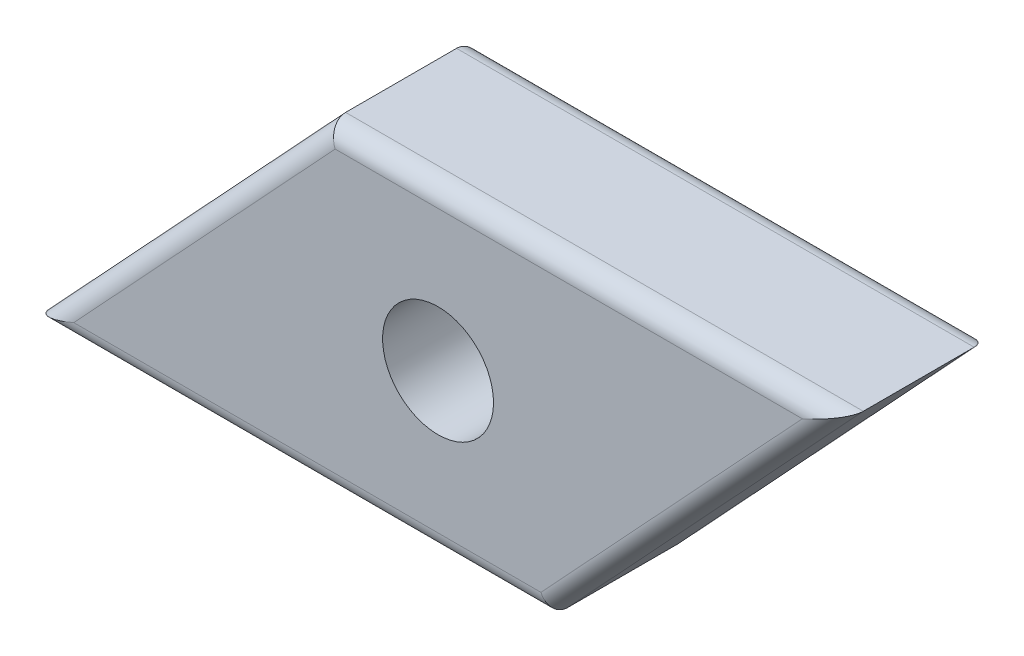
ISO-10303-21;
HEADER;
FILE_DESCRIPTION(('STEP AP214'),'2;1');
FILE_NAME('part.step','',(''),(''),'','','');
FILE_SCHEMA(('AUTOMOTIVE_DESIGN { 1 0 10303 214 1 1 1 1 }'));
ENDSEC;
DATA;
#1=APPLICATION_CONTEXT('core data for automotive mechanical design processes');
#2=APPLICATION_PROTOCOL_DEFINITION('international standard','automotive_design',2000,#1);
#3=PRODUCT_CONTEXT('',#1,'mechanical');
#4=PRODUCT('Part','Part','',(#3));
#5=PRODUCT_RELATED_PRODUCT_CATEGORY('part','',(#4));
#6=PRODUCT_DEFINITION_FORMATION('','',#4);
#7=PRODUCT_DEFINITION_CONTEXT('part definition',#1,'design');
#8=PRODUCT_DEFINITION('design','',#6,#7);
#9=PRODUCT_DEFINITION_SHAPE('','',#8);
#10=(LENGTH_UNIT() NAMED_UNIT(*) SI_UNIT(.MILLI.,.METRE.));
#11=(NAMED_UNIT(*) PLANE_ANGLE_UNIT() SI_UNIT($,.RADIAN.));
#12=(NAMED_UNIT(*) SI_UNIT($,.STERADIAN.) SOLID_ANGLE_UNIT());
#13=UNCERTAINTY_MEASURE_WITH_UNIT(LENGTH_MEASURE(1.E-05),#10,'distance_accuracy_value','');
#14=(GEOMETRIC_REPRESENTATION_CONTEXT(3) GLOBAL_UNCERTAINTY_ASSIGNED_CONTEXT((#13)) GLOBAL_UNIT_ASSIGNED_CONTEXT((#10,
#11,#12)) REPRESENTATION_CONTEXT('',''));
#15=CARTESIAN_POINT('',(0.,0.,0.));
#16=DIRECTION('',(0.,0.,1.));
#17=DIRECTION('',(1.,0.,0.));
#18=AXIS2_PLACEMENT_3D('',#15,#16,#17);
#19=CARTESIAN_POINT('',(0.,0.,4.));
#20=DIRECTION('',(0.,0.,-1.));
#21=DIRECTION('',(-1.,0.,0.));
#22=AXIS2_PLACEMENT_3D('',#19,#20,#21);
#23=PLANE('',#22);
#24=DIRECTION('',(1.,0.,0.));
#25=VECTOR('',#24,1.);
#26=CARTESIAN_POINT('',(0.,-3.8,4.));
#27=LINE('',#26,#25);
#28=CARTESIAN_POINT('',(-9.8519978204639,-3.8,4.));
#29=VERTEX_POINT('',#28);
#30=CARTESIAN_POINT('',(2.78223037860344,-3.8,4.));
#31=VERTEX_POINT('',#30);
#32=EDGE_CURVE('E115',#29,#31,#27,.T.);
#33=ORIENTED_EDGE('',*,*,#32,.T.);
#34=DIRECTION('',(0.681103942477287,0.732186738163084,0.));
#35=VECTOR('',#34,1.);
#36=CARTESIAN_POINT('',(3.38658856771173,-3.15031494670859,4.));
#37=LINE('',#36,#35);
#38=CARTESIAN_POINT('',(9.8519978204639,3.8,4.));
#39=VERTEX_POINT('',#38);
#40=EDGE_CURVE('E9',#31,#39,#37,.T.);
#41=ORIENTED_EDGE('',*,*,#40,.T.);
#42=DIRECTION('',(-1.,0.,0.));
#43=VECTOR('',#42,1.);
#44=CARTESIAN_POINT('',(0.,3.8,4.));
#45=LINE('',#44,#43);
#46=CARTESIAN_POINT('',(-2.78223037860344,3.8,4.));
#47=VERTEX_POINT('',#46);
#48=EDGE_CURVE('E24',#39,#47,#45,.T.);
#49=ORIENTED_EDGE('',*,*,#48,.T.);
#50=DIRECTION('',(-0.681103942477287,-0.732186738163084,0.));
#51=VECTOR('',#50,1.);
#52=CARTESIAN_POINT('',(-3.38658856771173,3.15031494670859,4.));
#53=LINE('',#52,#51);
#54=EDGE_CURVE('E133',#47,#29,#53,.T.);
#55=ORIENTED_EDGE('',*,*,#54,.T.);
#56=EDGE_LOOP('',(#33,#41,#49,#55));
#57=FACE_BOUND('',#56,.T.);
#58=CARTESIAN_POINT('',(0.,0.,4.));
#59=DIRECTION('',(0.,0.,1.));
#60=DIRECTION('',(1.,0.,0.));
#61=AXIS2_PLACEMENT_3D('',#58,#59,#60);
#62=CIRCLE('',#61,1.5);
#63=CARTESIAN_POINT('',(1.5,0.,4.));
#64=VERTEX_POINT('',#63);
#65=EDGE_CURVE('E160',#64,#64,#62,.T.);
#66=ORIENTED_EDGE('',*,*,#65,.F.);
#67=EDGE_LOOP('',(#66));
#68=FACE_BOUND('',#67,.T.);
#69=ADVANCED_FACE('F15',(#57,#68),#23,.F.);
#70=CARTESIAN_POINT('',(0.,0.,0.));
#71=DIRECTION('',(0.,0.,-1.));
#72=DIRECTION('',(-1.,0.,0.));
#73=AXIS2_PLACEMENT_3D('',#70,#71,#72);
#74=PLANE('',#73);
#75=DIRECTION('',(1.,0.,0.));
#76=VECTOR('',#75,1.);
#77=CARTESIAN_POINT('',(-11.,-3.8,0.));
#78=LINE('',#77,#76);
#79=CARTESIAN_POINT('',(2.78223037860344,-3.8,0.));
#80=VERTEX_POINT('',#79);
#81=CARTESIAN_POINT('',(-9.85199782046391,-3.8,0.));
#82=VERTEX_POINT('',#81);
#83=EDGE_CURVE('E151',#80,#82,#78,.F.);
#84=ORIENTED_EDGE('',*,*,#83,.T.);
#85=DIRECTION('',(-0.681103942477287,-0.732186738163084,0.));
#86=VECTOR('',#85,1.);
#87=CARTESIAN_POINT('',(-2.63390663091846,3.95944802876136,0.));
#88=LINE('',#87,#86);
#89=CARTESIAN_POINT('',(-2.78223037860344,3.8,0.));
#90=VERTEX_POINT('',#89);
#91=EDGE_CURVE('E144',#82,#90,#88,.F.);
#92=ORIENTED_EDGE('',*,*,#91,.T.);
#93=DIRECTION('',(-1.,0.,0.));
#94=VECTOR('',#93,1.);
#95=CARTESIAN_POINT('',(11.,3.8,0.));
#96=LINE('',#95,#94);
#97=CARTESIAN_POINT('',(9.8519978204639,3.8,0.));
#98=VERTEX_POINT('',#97);
#99=EDGE_CURVE('E147',#90,#98,#96,.F.);
#100=ORIENTED_EDGE('',*,*,#99,.T.);
#101=DIRECTION('',(0.681103942477287,0.732186738163084,0.));
#102=VECTOR('',#101,1.);
#103=CARTESIAN_POINT('',(2.63390663091846,-3.95944802876136,0.));
#104=LINE('',#103,#102);
#105=EDGE_CURVE('E149',#98,#80,#104,.F.);
#106=ORIENTED_EDGE('',*,*,#105,.T.);
#107=EDGE_LOOP('',(#84,#92,#100,#106));
#108=FACE_BOUND('',#107,.T.);
#109=CARTESIAN_POINT('',(0.,0.,0.));
#110=DIRECTION('',(0.,0.,1.));
#111=DIRECTION('',(1.,0.,0.));
#112=AXIS2_PLACEMENT_3D('',#109,#110,#111);
#113=CIRCLE('',#112,1.5);
#114=CARTESIAN_POINT('',(1.5,0.,0.));
#115=VERTEX_POINT('',#114);
#116=EDGE_CURVE('E127',#115,#115,#113,.T.);
#117=ORIENTED_EDGE('',*,*,#116,.T.);
#118=EDGE_LOOP('',(#117));
#119=FACE_BOUND('',#118,.T.);
#120=ADVANCED_FACE('F170',(#108,#119),#74,.T.);
#121=CARTESIAN_POINT('',(-11.,-4.3,4.));
#122=DIRECTION('',(0.732186738163084,-0.681103942477287,0.));
#123=DIRECTION('',(0.681103942477287,0.732186738163084,0.));
#124=AXIS2_PLACEMENT_3D('',#121,#122,#123);
#125=PLANE('',#124);
#126=DIRECTION('',(0.,0.,-1.));
#127=VECTOR('',#126,1.);
#128=CARTESIAN_POINT('',(-3.,4.3,4.));
#129=LINE('',#128,#127);
#130=CARTESIAN_POINT('',(-3.,4.3,3.5));
#131=VERTEX_POINT('',#130);
#132=CARTESIAN_POINT('',(-3.,4.3,0.5));
#133=VERTEX_POINT('',#132);
#134=EDGE_CURVE('E158',#131,#133,#129,.T.);
#135=ORIENTED_EDGE('',*,*,#134,.T.);
#136=DIRECTION('',(-0.681103942477287,-0.732186738163084,0.));
#137=VECTOR('',#136,1.);
#138=CARTESIAN_POINT('',(-11.,-4.3,0.5));
#139=LINE('',#138,#137);
#140=CARTESIAN_POINT('',(-11.,-4.3,0.5));
#141=VERTEX_POINT('',#140);
#142=EDGE_CURVE('E104',#133,#141,#139,.T.);
#143=ORIENTED_EDGE('',*,*,#142,.T.);
#144=DIRECTION('',(0.,0.,-1.));
#145=VECTOR('',#144,1.);
#146=CARTESIAN_POINT('',(-11.,-4.3,4.));
#147=LINE('',#146,#145);
#148=CARTESIAN_POINT('',(-11.,-4.3,3.5));
#149=VERTEX_POINT('',#148);
#150=EDGE_CURVE('E86',#149,#141,#147,.T.);
#151=ORIENTED_EDGE('',*,*,#150,.F.);
#152=DIRECTION('',(-0.681103942477287,-0.732186738163084,0.));
#153=VECTOR('',#152,1.);
#154=CARTESIAN_POINT('',(-11.,-4.3,3.5));
#155=LINE('',#154,#153);
#156=EDGE_CURVE('E101',#149,#131,#155,.F.);
#157=ORIENTED_EDGE('',*,*,#156,.T.);
#158=EDGE_LOOP('',(#135,#143,#151,#157));
#159=FACE_BOUND('',#158,.T.);
#160=ADVANCED_FACE('F100',(#159),#125,.F.);
#161=CARTESIAN_POINT('',(3.,-4.3,4.));
#162=DIRECTION('',(0.,1.,0.));
#163=DIRECTION('',(0.,0.,1.));
#164=AXIS2_PLACEMENT_3D('',#161,#162,#163);
#165=PLANE('',#164);
#166=ORIENTED_EDGE('',*,*,#150,.T.);
#167=DIRECTION('',(1.,0.,0.));
#168=VECTOR('',#167,1.);
#169=CARTESIAN_POINT('',(3.,-4.3,0.5));
#170=LINE('',#169,#168);
#171=CARTESIAN_POINT('',(3.,-4.3,0.5));
#172=VERTEX_POINT('',#171);
#173=EDGE_CURVE('E93',#141,#172,#170,.T.);
#174=ORIENTED_EDGE('',*,*,#173,.T.);
#175=DIRECTION('',(0.,0.,-1.));
#176=VECTOR('',#175,1.);
#177=CARTESIAN_POINT('',(3.,-4.3,4.));
#178=LINE('',#177,#176);
#179=CARTESIAN_POINT('',(3.,-4.3,3.5));
#180=VERTEX_POINT('',#179);
#181=EDGE_CURVE('E88',#180,#172,#178,.T.);
#182=ORIENTED_EDGE('',*,*,#181,.F.);
#183=DIRECTION('',(1.,0.,0.));
#184=VECTOR('',#183,1.);
#185=CARTESIAN_POINT('',(3.,-4.3,3.5));
#186=LINE('',#185,#184);
#187=EDGE_CURVE('E83',#180,#149,#186,.F.);
#188=ORIENTED_EDGE('',*,*,#187,.T.);
#189=EDGE_LOOP('',(#166,#174,#182,#188));
#190=FACE_BOUND('',#189,.T.);
#191=ADVANCED_FACE('F85',(#190),#165,.F.);
#192=CARTESIAN_POINT('',(11.,4.3,4.));
#193=DIRECTION('',(-0.732186738163084,0.681103942477287,0.));
#194=DIRECTION('',(-0.681103942477287,-0.732186738163084,0.));
#195=AXIS2_PLACEMENT_3D('',#192,#193,#194);
#196=PLANE('',#195);
#197=ORIENTED_EDGE('',*,*,#181,.T.);
#198=DIRECTION('',(0.681103942477287,0.732186738163084,0.));
#199=VECTOR('',#198,1.);
#200=CARTESIAN_POINT('',(11.,4.3,0.5));
#201=LINE('',#200,#199);
#202=CARTESIAN_POINT('',(11.,4.3,0.5));
#203=VERTEX_POINT('',#202);
#204=EDGE_CURVE('E94',#172,#203,#201,.T.);
#205=ORIENTED_EDGE('',*,*,#204,.T.);
#206=DIRECTION('',(0.,0.,-1.));
#207=VECTOR('',#206,1.);
#208=CARTESIAN_POINT('',(11.,4.3,4.));
#209=LINE('',#208,#207);
#210=CARTESIAN_POINT('',(11.,4.3,3.5));
#211=VERTEX_POINT('',#210);
#212=EDGE_CURVE('E155',#211,#203,#209,.T.);
#213=ORIENTED_EDGE('',*,*,#212,.F.);
#214=DIRECTION('',(0.681103942477287,0.732186738163084,0.));
#215=VECTOR('',#214,1.);
#216=CARTESIAN_POINT('',(11.,4.3,3.5));
#217=LINE('',#216,#215);
#218=EDGE_CURVE('E138',#211,#180,#217,.F.);
#219=ORIENTED_EDGE('',*,*,#218,.T.);
#220=EDGE_LOOP('',(#197,#205,#213,#219));
#221=FACE_BOUND('',#220,.T.);
#222=ADVANCED_FACE('F183',(#221),#196,.F.);
#223=CARTESIAN_POINT('',(-3.,4.3,4.));
#224=DIRECTION('',(0.,-1.,0.));
#225=DIRECTION('',(0.,0.,-1.));
#226=AXIS2_PLACEMENT_3D('',#223,#224,#225);
#227=PLANE('',#226);
#228=ORIENTED_EDGE('',*,*,#212,.T.);
#229=DIRECTION('',(-1.,0.,0.));
#230=VECTOR('',#229,1.);
#231=CARTESIAN_POINT('',(-3.,4.3,0.5));
#232=LINE('',#231,#230);
#233=EDGE_CURVE('E140',#203,#133,#232,.T.);
#234=ORIENTED_EDGE('',*,*,#233,.T.);
#235=ORIENTED_EDGE('',*,*,#134,.F.);
#236=DIRECTION('',(-1.,0.,0.));
#237=VECTOR('',#236,1.);
#238=CARTESIAN_POINT('',(-3.,4.3,3.5));
#239=LINE('',#238,#237);
#240=EDGE_CURVE('E142',#131,#211,#239,.F.);
#241=ORIENTED_EDGE('',*,*,#240,.T.);
#242=EDGE_LOOP('',(#228,#234,#235,#241));
#243=FACE_BOUND('',#242,.T.);
#244=ADVANCED_FACE('F180',(#243),#227,.F.);
#245=CARTESIAN_POINT('',(0.,0.,4.));
#246=DIRECTION('',(0.,0.,-1.));
#247=DIRECTION('',(-1.,0.,0.));
#248=AXIS2_PLACEMENT_3D('',#245,#246,#247);
#249=CYLINDRICAL_SURFACE('',#248,1.5);
#250=ORIENTED_EDGE('',*,*,#65,.T.);
#251=EDGE_LOOP('',(#250));
#252=FACE_BOUND('',#251,.T.);
#253=ORIENTED_EDGE('',*,*,#116,.F.);
#254=EDGE_LOOP('',(#253));
#255=FACE_BOUND('',#254,.T.);
#256=ADVANCED_FACE('F166',(#252,#255),#249,.F.);
#257=CARTESIAN_POINT('',(10.6339066309185,4.64055197123864,0.5));
#258=DIRECTION('',(-0.681103942477287,-0.732186738163084,0.));
#259=DIRECTION('',(0.732186738163084,-0.681103942477287,0.));
#260=AXIS2_PLACEMENT_3D('',#257,#258,#259);
#261=CYLINDRICAL_SURFACE('',#260,0.5);
#262=CARTESIAN_POINT('',(2.78223037860344,-3.8,0.5));
#263=DIRECTION('',(-0.916816214537376,-0.399309439860062,0.));
#264=DIRECTION('',(-0.399309439860062,0.916816214537376,0.));
#265=AXIS2_PLACEMENT_3D('',#262,#263,#264);
#266=ELLIPSE('',#265,0.545365572807086,0.5);
#267=EDGE_CURVE('E128',#80,#172,#266,.T.);
#268=ORIENTED_EDGE('',*,*,#267,.F.);
#269=ORIENTED_EDGE('',*,*,#105,.F.);
#270=CARTESIAN_POINT('',(9.8519978204639,3.8,0.5));
#271=DIRECTION('',(0.399309439860062,-0.916816214537376,0.));
#272=DIRECTION('',(-0.916816214537376,-0.399309439860062,0.));
#273=AXIS2_PLACEMENT_3D('',#270,#271,#272);
#274=ELLIPSE('',#273,1.25216173245297,0.5);
#275=EDGE_CURVE('E124',#203,#98,#274,.F.);
#276=ORIENTED_EDGE('',*,*,#275,.F.);
#277=ORIENTED_EDGE('',*,*,#204,.F.);
#278=EDGE_LOOP('',(#268,#269,#276,#277));
#279=FACE_BOUND('',#278,.T.);
#280=ADVANCED_FACE('F203',(#279),#261,.T.);
#281=CARTESIAN_POINT('',(-3.,3.8,0.5));
#282=DIRECTION('',(1.,0.,0.));
#283=DIRECTION('',(0.,0.,-1.));
#284=AXIS2_PLACEMENT_3D('',#281,#282,#283);
#285=CYLINDRICAL_SURFACE('',#284,0.5);
#286=ORIENTED_EDGE('',*,*,#275,.T.);
#287=ORIENTED_EDGE('',*,*,#99,.F.);
#288=CARTESIAN_POINT('',(-2.78223037860344,3.8,0.5));
#289=DIRECTION('',(0.916816214537376,0.399309439860062,0.));
#290=DIRECTION('',(0.399309439860062,-0.916816214537376,0.));
#291=AXIS2_PLACEMENT_3D('',#288,#289,#290);
#292=ELLIPSE('',#291,0.545365572807086,0.5);
#293=EDGE_CURVE('E117',#133,#90,#292,.F.);
#294=ORIENTED_EDGE('',*,*,#293,.F.);
#295=ORIENTED_EDGE('',*,*,#233,.F.);
#296=EDGE_LOOP('',(#286,#287,#294,#295));
#297=FACE_BOUND('',#296,.T.);
#298=ADVANCED_FACE('F199',(#297),#285,.T.);
#299=CARTESIAN_POINT('',(3.,-3.8,0.5));
#300=DIRECTION('',(-1.,0.,0.));
#301=DIRECTION('',(0.,0.,1.));
#302=AXIS2_PLACEMENT_3D('',#299,#300,#301);
#303=CYLINDRICAL_SURFACE('',#302,0.5);
#304=ORIENTED_EDGE('',*,*,#267,.T.);
#305=ORIENTED_EDGE('',*,*,#173,.F.);
#306=CARTESIAN_POINT('',(-9.8519978204639,-3.8,0.5));
#307=DIRECTION('',(-0.399309439860062,0.916816214537376,0.));
#308=DIRECTION('',(-0.916816214537376,-0.399309439860062,0.));
#309=AXIS2_PLACEMENT_3D('',#306,#307,#308);
#310=ELLIPSE('',#309,1.25216173245297,0.5);
#311=EDGE_CURVE('E116',#82,#141,#310,.T.);
#312=ORIENTED_EDGE('',*,*,#311,.F.);
#313=ORIENTED_EDGE('',*,*,#83,.F.);
#314=EDGE_LOOP('',(#304,#305,#312,#313));
#315=FACE_BOUND('',#314,.T.);
#316=ADVANCED_FACE('F195',(#315),#303,.T.);
#317=CARTESIAN_POINT('',(-10.6339066309185,-4.64055197123864,0.5));
#318=DIRECTION('',(0.681103942477287,0.732186738163084,0.));
#319=DIRECTION('',(-0.732186738163084,0.681103942477287,0.));
#320=AXIS2_PLACEMENT_3D('',#317,#318,#319);
#321=CYLINDRICAL_SURFACE('',#320,0.5);
#322=ORIENTED_EDGE('',*,*,#293,.T.);
#323=ORIENTED_EDGE('',*,*,#91,.F.);
#324=ORIENTED_EDGE('',*,*,#311,.T.);
#325=ORIENTED_EDGE('',*,*,#142,.F.);
#326=EDGE_LOOP('',(#322,#323,#324,#325));
#327=FACE_BOUND('',#326,.T.);
#328=ADVANCED_FACE('F192',(#327),#321,.T.);
#329=CARTESIAN_POINT('',(-3.38658856771173,3.15031494670859,3.5));
#330=DIRECTION('',(-0.681103942477287,-0.732186738163084,0.));
#331=DIRECTION('',(0.732186738163084,-0.681103942477287,0.));
#332=AXIS2_PLACEMENT_3D('',#329,#330,#331);
#333=CYLINDRICAL_SURFACE('',#332,0.5);
#334=CARTESIAN_POINT('',(-2.78223037860344,3.8,3.5));
#335=DIRECTION('',(-0.916816214537376,-0.399309439860062,0.));
#336=DIRECTION('',(0.399309439860062,-0.916816214537376,0.));
#337=AXIS2_PLACEMENT_3D('',#334,#335,#336);
#338=ELLIPSE('',#337,0.545365572807086,0.5);
#339=EDGE_CURVE('E111',#131,#47,#338,.F.);
#340=ORIENTED_EDGE('',*,*,#339,.F.);
#341=ORIENTED_EDGE('',*,*,#156,.F.);
#342=CARTESIAN_POINT('',(-9.8519978204639,-3.8,3.5));
#343=DIRECTION('',(0.399309439860062,-0.916816214537376,0.));
#344=DIRECTION('',(0.916816214537376,0.399309439860062,0.));
#345=AXIS2_PLACEMENT_3D('',#342,#343,#344);
#346=ELLIPSE('',#345,1.25216173245297,0.5);
#347=EDGE_CURVE('E19',#29,#149,#346,.T.);
#348=ORIENTED_EDGE('',*,*,#347,.F.);
#349=ORIENTED_EDGE('',*,*,#54,.F.);
#350=EDGE_LOOP('',(#340,#341,#348,#349));
#351=FACE_BOUND('',#350,.T.);
#352=ADVANCED_FACE('F17',(#351),#333,.T.);
#353=CARTESIAN_POINT('',(0.,-3.8,3.5));
#354=DIRECTION('',(1.,0.,0.));
#355=DIRECTION('',(0.,0.,-1.));
#356=AXIS2_PLACEMENT_3D('',#353,#354,#355);
#357=CYLINDRICAL_SURFACE('',#356,0.5);
#358=ORIENTED_EDGE('',*,*,#347,.T.);
#359=ORIENTED_EDGE('',*,*,#187,.F.);
#360=CARTESIAN_POINT('',(2.78223037860344,-3.8,3.5));
#361=DIRECTION('',(0.916816214537376,0.399309439860062,0.));
#362=DIRECTION('',(0.399309439860062,-0.916816214537376,0.));
#363=AXIS2_PLACEMENT_3D('',#360,#361,#362);
#364=ELLIPSE('',#363,0.545365572807086,0.5);
#365=EDGE_CURVE('E119',#31,#180,#364,.T.);
#366=ORIENTED_EDGE('',*,*,#365,.F.);
#367=ORIENTED_EDGE('',*,*,#32,.F.);
#368=EDGE_LOOP('',(#358,#359,#366,#367));
#369=FACE_BOUND('',#368,.T.);
#370=ADVANCED_FACE('F114',(#369),#357,.T.);
#371=CARTESIAN_POINT('',(0.,3.8,3.5));
#372=DIRECTION('',(-1.,0.,0.));
#373=DIRECTION('',(0.,0.,1.));
#374=AXIS2_PLACEMENT_3D('',#371,#372,#373);
#375=CYLINDRICAL_SURFACE('',#374,0.5);
#376=ORIENTED_EDGE('',*,*,#339,.T.);
#377=ORIENTED_EDGE('',*,*,#48,.F.);
#378=CARTESIAN_POINT('',(9.8519978204639,3.8,3.5));
#379=DIRECTION('',(-0.399309439860062,0.916816214537376,0.));
#380=DIRECTION('',(-0.916816214537376,-0.399309439860062,0.));
#381=AXIS2_PLACEMENT_3D('',#378,#379,#380);
#382=ELLIPSE('',#381,1.25216173245297,0.5);
#383=EDGE_CURVE('E32',#211,#39,#382,.F.);
#384=ORIENTED_EDGE('',*,*,#383,.F.);
#385=ORIENTED_EDGE('',*,*,#240,.F.);
#386=EDGE_LOOP('',(#376,#377,#384,#385));
#387=FACE_BOUND('',#386,.T.);
#388=ADVANCED_FACE('F211',(#387),#375,.T.);
#389=CARTESIAN_POINT('',(3.38658856771173,-3.15031494670859,3.5));
#390=DIRECTION('',(0.681103942477287,0.732186738163084,0.));
#391=DIRECTION('',(-0.732186738163084,0.681103942477287,0.));
#392=AXIS2_PLACEMENT_3D('',#389,#390,#391);
#393=CYLINDRICAL_SURFACE('',#392,0.5);
#394=ORIENTED_EDGE('',*,*,#365,.T.);
#395=ORIENTED_EDGE('',*,*,#218,.F.);
#396=ORIENTED_EDGE('',*,*,#383,.T.);
#397=ORIENTED_EDGE('',*,*,#40,.F.);
#398=EDGE_LOOP('',(#394,#395,#396,#397));
#399=FACE_BOUND('',#398,.T.);
#400=ADVANCED_FACE('F208',(#399),#393,.T.);
#401=CLOSED_SHELL('',(#69,#120,#160,#191,#222,#244,#256,#280,#298,#316,#328,#352,#370,#388,#400));
#402=MANIFOLD_SOLID_BREP('B1',#401);
#403=ADVANCED_BREP_SHAPE_REPRESENTATION('',(#18,#402),#14);
#404=SHAPE_DEFINITION_REPRESENTATION(#9,#403);
ENDSEC;
END-ISO-10303-21;
